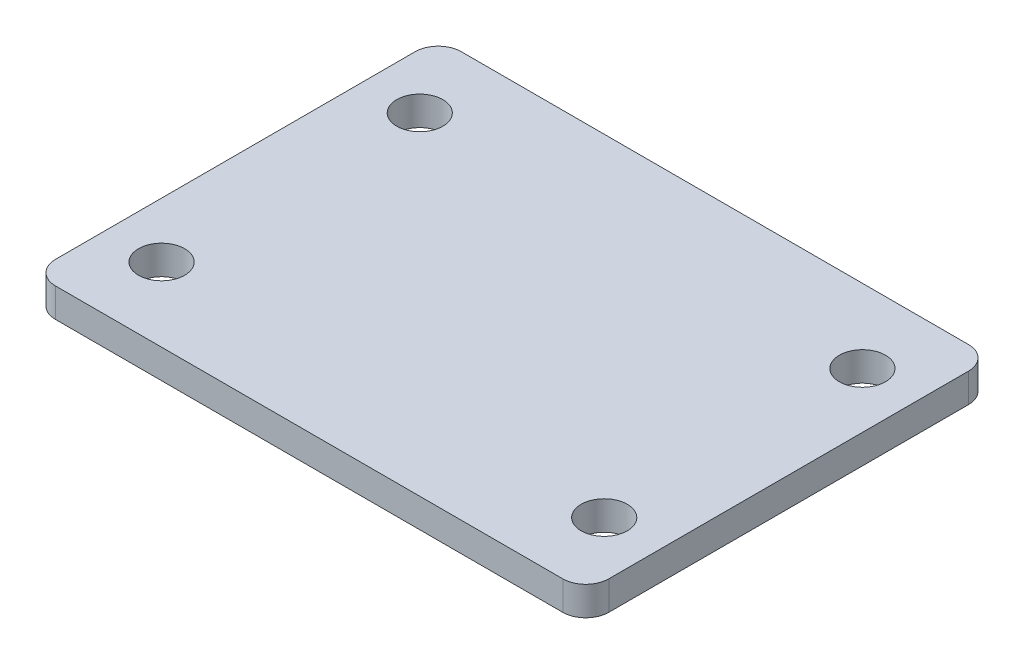
ISO-10303-21;
HEADER;
FILE_DESCRIPTION(('STEP AP214'),'2;1');
FILE_NAME('part.step','',(''),(''),'','','');
FILE_SCHEMA(('AUTOMOTIVE_DESIGN { 1 0 10303 214 1 1 1 1 }'));
ENDSEC;
DATA;
#1=APPLICATION_CONTEXT('core data for automotive mechanical design processes');
#2=APPLICATION_PROTOCOL_DEFINITION('international standard','automotive_design',2000,#1);
#3=PRODUCT_CONTEXT('',#1,'mechanical');
#4=PRODUCT('Part','Part','',(#3));
#5=PRODUCT_RELATED_PRODUCT_CATEGORY('part','',(#4));
#6=PRODUCT_DEFINITION_FORMATION('','',#4);
#7=PRODUCT_DEFINITION_CONTEXT('part definition',#1,'design');
#8=PRODUCT_DEFINITION('design','',#6,#7);
#9=PRODUCT_DEFINITION_SHAPE('','',#8);
#10=(LENGTH_UNIT() NAMED_UNIT(*) SI_UNIT(.MILLI.,.METRE.));
#11=(NAMED_UNIT(*) PLANE_ANGLE_UNIT() SI_UNIT($,.RADIAN.));
#12=(NAMED_UNIT(*) SI_UNIT($,.STERADIAN.) SOLID_ANGLE_UNIT());
#13=UNCERTAINTY_MEASURE_WITH_UNIT(LENGTH_MEASURE(1.E-05),#10,'distance_accuracy_value','');
#14=(GEOMETRIC_REPRESENTATION_CONTEXT(3) GLOBAL_UNCERTAINTY_ASSIGNED_CONTEXT((#13)) GLOBAL_UNIT_ASSIGNED_CONTEXT((#10,
#11,#12)) REPRESENTATION_CONTEXT('',''));
#15=CARTESIAN_POINT('',(0.,0.,0.));
#16=DIRECTION('',(0.,0.,1.));
#17=DIRECTION('',(1.,0.,0.));
#18=AXIS2_PLACEMENT_3D('',#15,#16,#17);
#19=CARTESIAN_POINT('',(-43.6626,5.,30.9626));
#20=DIRECTION('',(0.,1.,0.));
#21=DIRECTION('',(0.,0.,1.));
#22=AXIS2_PLACEMENT_3D('',#19,#20,#21);
#23=PLANE('',#22);
#24=CARTESIAN_POINT('',(38.1,5.,22.225));
#25=DIRECTION('',(0.,1.,0.));
#26=DIRECTION('',(0.,0.,1.));
#27=AXIS2_PLACEMENT_3D('',#24,#25,#26);
#28=CIRCLE('',#27,3.96875);
#29=CARTESIAN_POINT('',(38.1,5.,26.19375));
#30=VERTEX_POINT('',#29);
#31=EDGE_CURVE('E191',#30,#30,#28,.T.);
#32=ORIENTED_EDGE('',*,*,#31,.F.);
#33=EDGE_LOOP('',(#32));
#34=FACE_BOUND('',#33,.T.);
#35=CARTESIAN_POINT('',(-38.1,5.,-22.225));
#36=DIRECTION('',(0.,1.,0.));
#37=DIRECTION('',(0.,0.,1.));
#38=AXIS2_PLACEMENT_3D('',#35,#36,#37);
#39=CIRCLE('',#38,3.96875);
#40=CARTESIAN_POINT('',(-38.1,5.,-18.25625));
#41=VERTEX_POINT('',#40);
#42=EDGE_CURVE('E137',#41,#41,#39,.T.);
#43=ORIENTED_EDGE('',*,*,#42,.F.);
#44=EDGE_LOOP('',(#43));
#45=FACE_BOUND('',#44,.T.);
#46=CARTESIAN_POINT('',(-43.6626,5.,30.9626));
#47=DIRECTION('',(0.,1.,0.));
#48=DIRECTION('',(0.,0.,1.));
#49=AXIS2_PLACEMENT_3D('',#46,#47,#48);
#50=CIRCLE('',#49,3.9624);
#51=CARTESIAN_POINT('',(-47.625,5.,30.9626));
#52=VERTEX_POINT('',#51);
#53=CARTESIAN_POINT('',(-43.6626,5.,34.925));
#54=VERTEX_POINT('',#53);
#55=EDGE_CURVE('E148',#52,#54,#50,.T.);
#56=ORIENTED_EDGE('',*,*,#55,.T.);
#57=DIRECTION('',(1.,0.,0.));
#58=VECTOR('',#57,1.);
#59=CARTESIAN_POINT('',(-43.6626,5.,34.925));
#60=LINE('',#59,#58);
#61=CARTESIAN_POINT('',(43.6626,5.,34.925));
#62=VERTEX_POINT('',#61);
#63=EDGE_CURVE('E96',#54,#62,#60,.T.);
#64=ORIENTED_EDGE('',*,*,#63,.T.);
#65=CARTESIAN_POINT('',(43.6626,5.,30.9626));
#66=DIRECTION('',(0.,1.,0.));
#67=DIRECTION('',(0.,0.,1.));
#68=AXIS2_PLACEMENT_3D('',#65,#66,#67);
#69=CIRCLE('',#68,3.9624);
#70=CARTESIAN_POINT('',(47.625,5.,30.9626));
#71=VERTEX_POINT('',#70);
#72=EDGE_CURVE('E163',#62,#71,#69,.T.);
#73=ORIENTED_EDGE('',*,*,#72,.T.);
#74=DIRECTION('',(0.,0.,-1.));
#75=VECTOR('',#74,1.);
#76=CARTESIAN_POINT('',(47.625,5.,-30.9626));
#77=LINE('',#76,#75);
#78=CARTESIAN_POINT('',(47.625,5.,-30.9626));
#79=VERTEX_POINT('',#78);
#80=EDGE_CURVE('E176',#71,#79,#77,.T.);
#81=ORIENTED_EDGE('',*,*,#80,.T.);
#82=CARTESIAN_POINT('',(43.6626,5.,-30.9626));
#83=DIRECTION('',(0.,1.,0.));
#84=DIRECTION('',(0.,0.,-1.));
#85=AXIS2_PLACEMENT_3D('',#82,#83,#84);
#86=CIRCLE('',#85,3.9624);
#87=CARTESIAN_POINT('',(43.6626,5.,-34.925));
#88=VERTEX_POINT('',#87);
#89=EDGE_CURVE('E115',#79,#88,#86,.T.);
#90=ORIENTED_EDGE('',*,*,#89,.T.);
#91=DIRECTION('',(-1.,0.,0.));
#92=VECTOR('',#91,1.);
#93=CARTESIAN_POINT('',(-43.6626,5.,-34.925));
#94=LINE('',#93,#92);
#95=CARTESIAN_POINT('',(-43.6626,5.,-34.925));
#96=VERTEX_POINT('',#95);
#97=EDGE_CURVE('E109',#88,#96,#94,.T.);
#98=ORIENTED_EDGE('',*,*,#97,.T.);
#99=CARTESIAN_POINT('',(-43.6626,5.,-30.9626));
#100=DIRECTION('',(0.,1.,0.));
#101=DIRECTION('',(0.,0.,1.));
#102=AXIS2_PLACEMENT_3D('',#99,#100,#101);
#103=CIRCLE('',#102,3.9624);
#104=CARTESIAN_POINT('',(-47.625,5.,-30.9626));
#105=VERTEX_POINT('',#104);
#106=EDGE_CURVE('E113',#96,#105,#103,.T.);
#107=ORIENTED_EDGE('',*,*,#106,.T.);
#108=DIRECTION('',(0.,0.,1.));
#109=VECTOR('',#108,1.);
#110=CARTESIAN_POINT('',(-47.625,5.,-30.9626));
#111=LINE('',#110,#109);
#112=EDGE_CURVE('E53',#105,#52,#111,.T.);
#113=ORIENTED_EDGE('',*,*,#112,.T.);
#114=EDGE_LOOP('',(#56,#64,#73,#81,#90,#98,#107,#113));
#115=FACE_BOUND('',#114,.T.);
#116=CARTESIAN_POINT('',(-38.1,5.,22.225));
#117=DIRECTION('',(0.,1.,0.));
#118=DIRECTION('',(0.,0.,-1.));
#119=AXIS2_PLACEMENT_3D('',#116,#117,#118);
#120=CIRCLE('',#119,3.96875);
#121=CARTESIAN_POINT('',(-38.1,5.,18.25625));
#122=VERTEX_POINT('',#121);
#123=EDGE_CURVE('E185',#122,#122,#120,.T.);
#124=ORIENTED_EDGE('',*,*,#123,.F.);
#125=EDGE_LOOP('',(#124));
#126=FACE_BOUND('',#125,.T.);
#127=CARTESIAN_POINT('',(38.1,5.,-22.225));
#128=DIRECTION('',(0.,1.,0.));
#129=DIRECTION('',(0.,0.,-1.));
#130=AXIS2_PLACEMENT_3D('',#127,#128,#129);
#131=CIRCLE('',#130,3.96875);
#132=CARTESIAN_POINT('',(38.1,5.,-26.19375));
#133=VERTEX_POINT('',#132);
#134=EDGE_CURVE('E197',#133,#133,#131,.T.);
#135=ORIENTED_EDGE('',*,*,#134,.F.);
#136=EDGE_LOOP('',(#135));
#137=FACE_BOUND('',#136,.T.);
#138=ADVANCED_FACE('F36',(#34,#45,#115,#126,#137),#23,.T.);
#139=CARTESIAN_POINT('',(-43.6626,0.,30.9626));
#140=DIRECTION('',(0.,1.,0.));
#141=DIRECTION('',(0.,0.,1.));
#142=AXIS2_PLACEMENT_3D('',#139,#140,#141);
#143=PLANE('',#142);
#144=CARTESIAN_POINT('',(-43.6626,0.,30.9626));
#145=DIRECTION('',(0.,1.,0.));
#146=DIRECTION('',(0.,0.,1.));
#147=AXIS2_PLACEMENT_3D('',#144,#145,#146);
#148=CIRCLE('',#147,3.9624);
#149=CARTESIAN_POINT('',(-47.625,0.,30.9626));
#150=VERTEX_POINT('',#149);
#151=CARTESIAN_POINT('',(-43.6626,0.,34.925));
#152=VERTEX_POINT('',#151);
#153=EDGE_CURVE('E133',#150,#152,#148,.T.);
#154=ORIENTED_EDGE('',*,*,#153,.F.);
#155=DIRECTION('',(0.,0.,1.));
#156=VECTOR('',#155,1.);
#157=CARTESIAN_POINT('',(-47.625,0.,-30.9626));
#158=LINE('',#157,#156);
#159=CARTESIAN_POINT('',(-47.625,0.,-30.9626));
#160=VERTEX_POINT('',#159);
#161=EDGE_CURVE('E88',#160,#150,#158,.T.);
#162=ORIENTED_EDGE('',*,*,#161,.F.);
#163=CARTESIAN_POINT('',(-43.6626,0.,-30.9626));
#164=DIRECTION('',(0.,1.,0.));
#165=DIRECTION('',(0.,0.,1.));
#166=AXIS2_PLACEMENT_3D('',#163,#164,#165);
#167=CIRCLE('',#166,3.9624);
#168=CARTESIAN_POINT('',(-43.6626,0.,-34.925));
#169=VERTEX_POINT('',#168);
#170=EDGE_CURVE('E82',#169,#160,#167,.T.);
#171=ORIENTED_EDGE('',*,*,#170,.F.);
#172=DIRECTION('',(-1.,0.,0.));
#173=VECTOR('',#172,1.);
#174=CARTESIAN_POINT('',(-43.6626,0.,-34.925));
#175=LINE('',#174,#173);
#176=CARTESIAN_POINT('',(43.6626,0.,-34.925));
#177=VERTEX_POINT('',#176);
#178=EDGE_CURVE('E123',#177,#169,#175,.T.);
#179=ORIENTED_EDGE('',*,*,#178,.F.);
#180=CARTESIAN_POINT('',(43.6626,0.,-30.9626));
#181=DIRECTION('',(0.,1.,0.));
#182=DIRECTION('',(0.,0.,-1.));
#183=AXIS2_PLACEMENT_3D('',#180,#181,#182);
#184=CIRCLE('',#183,3.9624);
#185=CARTESIAN_POINT('',(47.625,0.,-30.9626));
#186=VERTEX_POINT('',#185);
#187=EDGE_CURVE('E143',#186,#177,#184,.T.);
#188=ORIENTED_EDGE('',*,*,#187,.F.);
#189=DIRECTION('',(0.,0.,-1.));
#190=VECTOR('',#189,1.);
#191=CARTESIAN_POINT('',(47.625,0.,-30.9626));
#192=LINE('',#191,#190);
#193=CARTESIAN_POINT('',(47.625,0.,30.9626));
#194=VERTEX_POINT('',#193);
#195=EDGE_CURVE('E141',#194,#186,#192,.T.);
#196=ORIENTED_EDGE('',*,*,#195,.F.);
#197=CARTESIAN_POINT('',(43.6626,0.,30.9626));
#198=DIRECTION('',(0.,1.,0.));
#199=DIRECTION('',(0.,0.,1.));
#200=AXIS2_PLACEMENT_3D('',#197,#198,#199);
#201=CIRCLE('',#200,3.9624);
#202=CARTESIAN_POINT('',(43.6626,0.,34.925));
#203=VERTEX_POINT('',#202);
#204=EDGE_CURVE('E139',#203,#194,#201,.T.);
#205=ORIENTED_EDGE('',*,*,#204,.F.);
#206=DIRECTION('',(1.,0.,0.));
#207=VECTOR('',#206,1.);
#208=CARTESIAN_POINT('',(-43.6626,0.,34.925));
#209=LINE('',#208,#207);
#210=EDGE_CURVE('E136',#152,#203,#209,.T.);
#211=ORIENTED_EDGE('',*,*,#210,.F.);
#212=EDGE_LOOP('',(#154,#162,#171,#179,#188,#196,#205,#211));
#213=FACE_BOUND('',#212,.T.);
#214=CARTESIAN_POINT('',(-38.1,0.,-22.225));
#215=DIRECTION('',(0.,1.,0.));
#216=DIRECTION('',(0.,0.,1.));
#217=AXIS2_PLACEMENT_3D('',#214,#215,#216);
#218=CIRCLE('',#217,3.96875);
#219=CARTESIAN_POINT('',(-38.1,0.,-18.25625));
#220=VERTEX_POINT('',#219);
#221=EDGE_CURVE('E182',#220,#220,#218,.T.);
#222=ORIENTED_EDGE('',*,*,#221,.T.);
#223=EDGE_LOOP('',(#222));
#224=FACE_BOUND('',#223,.T.);
#225=CARTESIAN_POINT('',(-38.1,0.,22.225));
#226=DIRECTION('',(0.,1.,0.));
#227=DIRECTION('',(0.,0.,-1.));
#228=AXIS2_PLACEMENT_3D('',#225,#226,#227);
#229=CIRCLE('',#228,3.96875);
#230=CARTESIAN_POINT('',(-38.1,0.,18.25625));
#231=VERTEX_POINT('',#230);
#232=EDGE_CURVE('E188',#231,#231,#229,.T.);
#233=ORIENTED_EDGE('',*,*,#232,.T.);
#234=EDGE_LOOP('',(#233));
#235=FACE_BOUND('',#234,.T.);
#236=CARTESIAN_POINT('',(38.1,0.,22.225));
#237=DIRECTION('',(0.,1.,0.));
#238=DIRECTION('',(0.,0.,1.));
#239=AXIS2_PLACEMENT_3D('',#236,#237,#238);
#240=CIRCLE('',#239,3.96875);
#241=CARTESIAN_POINT('',(38.1,0.,26.19375));
#242=VERTEX_POINT('',#241);
#243=EDGE_CURVE('E194',#242,#242,#240,.T.);
#244=ORIENTED_EDGE('',*,*,#243,.T.);
#245=EDGE_LOOP('',(#244));
#246=FACE_BOUND('',#245,.T.);
#247=CARTESIAN_POINT('',(38.1,0.,-22.225));
#248=DIRECTION('',(0.,1.,0.));
#249=DIRECTION('',(0.,0.,-1.));
#250=AXIS2_PLACEMENT_3D('',#247,#248,#249);
#251=CIRCLE('',#250,3.96875);
#252=CARTESIAN_POINT('',(38.1,0.,-26.19375));
#253=VERTEX_POINT('',#252);
#254=EDGE_CURVE('E200',#253,#253,#251,.T.);
#255=ORIENTED_EDGE('',*,*,#254,.T.);
#256=EDGE_LOOP('',(#255));
#257=FACE_BOUND('',#256,.T.);
#258=ADVANCED_FACE('F167',(#213,#224,#235,#246,#257),#143,.F.);
#259=CARTESIAN_POINT('',(-43.6626,5.,30.9626));
#260=DIRECTION('',(0.,-1.,0.));
#261=DIRECTION('',(0.,0.,-1.));
#262=AXIS2_PLACEMENT_3D('',#259,#260,#261);
#263=CYLINDRICAL_SURFACE('',#262,3.9624);
#264=ORIENTED_EDGE('',*,*,#153,.T.);
#265=DIRECTION('',(0.,-1.,0.));
#266=VECTOR('',#265,1.);
#267=CARTESIAN_POINT('',(-43.6626,5.,34.925));
#268=LINE('',#267,#266);
#269=EDGE_CURVE('E11',#54,#152,#268,.T.);
#270=ORIENTED_EDGE('',*,*,#269,.F.);
#271=ORIENTED_EDGE('',*,*,#55,.F.);
#272=DIRECTION('',(0.,-1.,0.));
#273=VECTOR('',#272,1.);
#274=CARTESIAN_POINT('',(-47.625,5.,30.9626));
#275=LINE('',#274,#273);
#276=EDGE_CURVE('E129',#52,#150,#275,.T.);
#277=ORIENTED_EDGE('',*,*,#276,.T.);
#278=EDGE_LOOP('',(#264,#270,#271,#277));
#279=FACE_BOUND('',#278,.T.);
#280=ADVANCED_FACE('F38',(#279),#263,.T.);
#281=CARTESIAN_POINT('',(-43.6626,5.,34.925));
#282=DIRECTION('',(0.,0.,-1.));
#283=DIRECTION('',(-1.,0.,0.));
#284=AXIS2_PLACEMENT_3D('',#281,#282,#283);
#285=PLANE('',#284);
#286=ORIENTED_EDGE('',*,*,#210,.T.);
#287=DIRECTION('',(0.,-1.,0.));
#288=VECTOR('',#287,1.);
#289=CARTESIAN_POINT('',(43.6626,5.,34.925));
#290=LINE('',#289,#288);
#291=EDGE_CURVE('E45',#62,#203,#290,.T.);
#292=ORIENTED_EDGE('',*,*,#291,.F.);
#293=ORIENTED_EDGE('',*,*,#63,.F.);
#294=ORIENTED_EDGE('',*,*,#269,.T.);
#295=EDGE_LOOP('',(#286,#292,#293,#294));
#296=FACE_BOUND('',#295,.T.);
#297=ADVANCED_FACE('F234',(#296),#285,.F.);
#298=CARTESIAN_POINT('',(43.6626,5.,30.9626));
#299=DIRECTION('',(0.,-1.,0.));
#300=DIRECTION('',(0.,0.,-1.));
#301=AXIS2_PLACEMENT_3D('',#298,#299,#300);
#302=CYLINDRICAL_SURFACE('',#301,3.9624);
#303=ORIENTED_EDGE('',*,*,#204,.T.);
#304=DIRECTION('',(0.,-1.,0.));
#305=VECTOR('',#304,1.);
#306=CARTESIAN_POINT('',(47.625,5.,30.9626));
#307=LINE('',#306,#305);
#308=EDGE_CURVE('E155',#71,#194,#307,.T.);
#309=ORIENTED_EDGE('',*,*,#308,.F.);
#310=ORIENTED_EDGE('',*,*,#72,.F.);
#311=ORIENTED_EDGE('',*,*,#291,.T.);
#312=EDGE_LOOP('',(#303,#309,#310,#311));
#313=FACE_BOUND('',#312,.T.);
#314=ADVANCED_FACE('F161',(#313),#302,.T.);
#315=CARTESIAN_POINT('',(47.625,5.,-30.9626));
#316=DIRECTION('',(-1.,0.,0.));
#317=DIRECTION('',(0.,0.,1.));
#318=AXIS2_PLACEMENT_3D('',#315,#316,#317);
#319=PLANE('',#318);
#320=ORIENTED_EDGE('',*,*,#195,.T.);
#321=DIRECTION('',(0.,-1.,0.));
#322=VECTOR('',#321,1.);
#323=CARTESIAN_POINT('',(47.625,5.,-30.9626));
#324=LINE('',#323,#322);
#325=EDGE_CURVE('E152',#79,#186,#324,.T.);
#326=ORIENTED_EDGE('',*,*,#325,.F.);
#327=ORIENTED_EDGE('',*,*,#80,.F.);
#328=ORIENTED_EDGE('',*,*,#308,.T.);
#329=EDGE_LOOP('',(#320,#326,#327,#328));
#330=FACE_BOUND('',#329,.T.);
#331=ADVANCED_FACE('F172',(#330),#319,.F.);
#332=CARTESIAN_POINT('',(43.6626,5.,-30.9626));
#333=DIRECTION('',(0.,-1.,0.));
#334=DIRECTION('',(0.,0.,-1.));
#335=AXIS2_PLACEMENT_3D('',#332,#333,#334);
#336=CYLINDRICAL_SURFACE('',#335,3.9624);
#337=ORIENTED_EDGE('',*,*,#187,.T.);
#338=DIRECTION('',(0.,-1.,0.));
#339=VECTOR('',#338,1.);
#340=CARTESIAN_POINT('',(43.6626,5.,-34.925));
#341=LINE('',#340,#339);
#342=EDGE_CURVE('E124',#88,#177,#341,.T.);
#343=ORIENTED_EDGE('',*,*,#342,.F.);
#344=ORIENTED_EDGE('',*,*,#89,.F.);
#345=ORIENTED_EDGE('',*,*,#325,.T.);
#346=EDGE_LOOP('',(#337,#343,#344,#345));
#347=FACE_BOUND('',#346,.T.);
#348=ADVANCED_FACE('F175',(#347),#336,.T.);
#349=CARTESIAN_POINT('',(-43.6626,5.,-34.925));
#350=DIRECTION('',(0.,0.,1.));
#351=DIRECTION('',(1.,0.,0.));
#352=AXIS2_PLACEMENT_3D('',#349,#350,#351);
#353=PLANE('',#352);
#354=ORIENTED_EDGE('',*,*,#178,.T.);
#355=DIRECTION('',(0.,-1.,0.));
#356=VECTOR('',#355,1.);
#357=CARTESIAN_POINT('',(-43.6626,5.,-34.925));
#358=LINE('',#357,#356);
#359=EDGE_CURVE('E120',#96,#169,#358,.T.);
#360=ORIENTED_EDGE('',*,*,#359,.F.);
#361=ORIENTED_EDGE('',*,*,#97,.F.);
#362=ORIENTED_EDGE('',*,*,#342,.T.);
#363=EDGE_LOOP('',(#354,#360,#361,#362));
#364=FACE_BOUND('',#363,.T.);
#365=ADVANCED_FACE('F121',(#364),#353,.F.);
#366=CARTESIAN_POINT('',(-43.6626,5.,-30.9626));
#367=DIRECTION('',(0.,-1.,0.));
#368=DIRECTION('',(0.,0.,-1.));
#369=AXIS2_PLACEMENT_3D('',#366,#367,#368);
#370=CYLINDRICAL_SURFACE('',#369,3.9624);
#371=ORIENTED_EDGE('',*,*,#170,.T.);
#372=DIRECTION('',(0.,-1.,0.));
#373=VECTOR('',#372,1.);
#374=CARTESIAN_POINT('',(-47.625,5.,-30.9626));
#375=LINE('',#374,#373);
#376=EDGE_CURVE('E125',#105,#160,#375,.T.);
#377=ORIENTED_EDGE('',*,*,#376,.F.);
#378=ORIENTED_EDGE('',*,*,#106,.F.);
#379=ORIENTED_EDGE('',*,*,#359,.T.);
#380=EDGE_LOOP('',(#371,#377,#378,#379));
#381=FACE_BOUND('',#380,.T.);
#382=ADVANCED_FACE('F127',(#381),#370,.T.);
#383=CARTESIAN_POINT('',(-47.625,5.,-30.9626));
#384=DIRECTION('',(1.,0.,0.));
#385=DIRECTION('',(0.,0.,-1.));
#386=AXIS2_PLACEMENT_3D('',#383,#384,#385);
#387=PLANE('',#386);
#388=ORIENTED_EDGE('',*,*,#161,.T.);
#389=ORIENTED_EDGE('',*,*,#276,.F.);
#390=ORIENTED_EDGE('',*,*,#112,.F.);
#391=ORIENTED_EDGE('',*,*,#376,.T.);
#392=EDGE_LOOP('',(#388,#389,#390,#391));
#393=FACE_BOUND('',#392,.T.);
#394=ADVANCED_FACE('F222',(#393),#387,.F.);
#395=CARTESIAN_POINT('',(-38.1,5.,-22.225));
#396=DIRECTION('',(0.,-1.,0.));
#397=DIRECTION('',(0.,0.,-1.));
#398=AXIS2_PLACEMENT_3D('',#395,#396,#397);
#399=CYLINDRICAL_SURFACE('',#398,3.96875);
#400=ORIENTED_EDGE('',*,*,#42,.T.);
#401=EDGE_LOOP('',(#400));
#402=FACE_BOUND('',#401,.T.);
#403=ORIENTED_EDGE('',*,*,#221,.F.);
#404=EDGE_LOOP('',(#403));
#405=FACE_BOUND('',#404,.T.);
#406=ADVANCED_FACE('F219',(#402,#405),#399,.F.);
#407=CARTESIAN_POINT('',(-38.1,5.,22.225));
#408=DIRECTION('',(0.,-1.,0.));
#409=DIRECTION('',(0.,0.,-1.));
#410=AXIS2_PLACEMENT_3D('',#407,#408,#409);
#411=CYLINDRICAL_SURFACE('',#410,3.96875);
#412=ORIENTED_EDGE('',*,*,#123,.T.);
#413=EDGE_LOOP('',(#412));
#414=FACE_BOUND('',#413,.T.);
#415=ORIENTED_EDGE('',*,*,#232,.F.);
#416=EDGE_LOOP('',(#415));
#417=FACE_BOUND('',#416,.T.);
#418=ADVANCED_FACE('F298',(#414,#417),#411,.F.);
#419=CARTESIAN_POINT('',(38.1,5.,22.225));
#420=DIRECTION('',(0.,-1.,0.));
#421=DIRECTION('',(0.,0.,-1.));
#422=AXIS2_PLACEMENT_3D('',#419,#420,#421);
#423=CYLINDRICAL_SURFACE('',#422,3.96875);
#424=ORIENTED_EDGE('',*,*,#31,.T.);
#425=EDGE_LOOP('',(#424));
#426=FACE_BOUND('',#425,.T.);
#427=ORIENTED_EDGE('',*,*,#243,.F.);
#428=EDGE_LOOP('',(#427));
#429=FACE_BOUND('',#428,.T.);
#430=ADVANCED_FACE('F306',(#426,#429),#423,.F.);
#431=CARTESIAN_POINT('',(38.1,5.,-22.225));
#432=DIRECTION('',(0.,-1.,0.));
#433=DIRECTION('',(0.,0.,-1.));
#434=AXIS2_PLACEMENT_3D('',#431,#432,#433);
#435=CYLINDRICAL_SURFACE('',#434,3.96875);
#436=ORIENTED_EDGE('',*,*,#134,.T.);
#437=EDGE_LOOP('',(#436));
#438=FACE_BOUND('',#437,.T.);
#439=ORIENTED_EDGE('',*,*,#254,.F.);
#440=EDGE_LOOP('',(#439));
#441=FACE_BOUND('',#440,.T.);
#442=ADVANCED_FACE('F206',(#438,#441),#435,.F.);
#443=CLOSED_SHELL('',(#138,#258,#280,#297,#314,#331,#348,#365,#382,#394,#406,#418,#430,#442));
#444=MANIFOLD_SOLID_BREP('B2',#443);
#445=ADVANCED_BREP_SHAPE_REPRESENTATION('',(#18,#444),#14);
#446=SHAPE_DEFINITION_REPRESENTATION(#9,#445);
ENDSEC;
END-ISO-10303-21;
